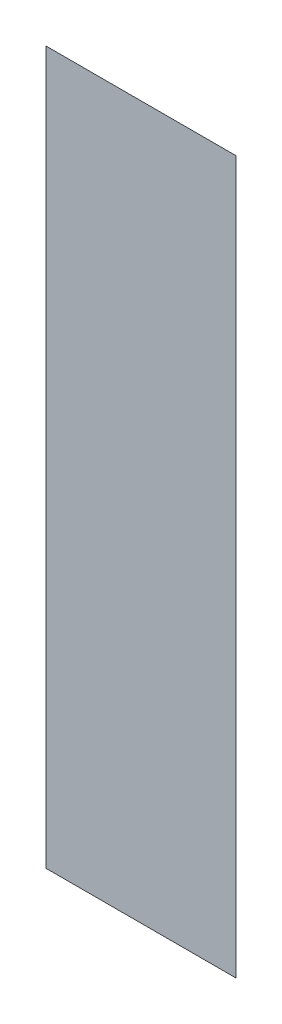
ISO-10303-21;
HEADER;
FILE_DESCRIPTION(('STEP AP214'),'2;1');
FILE_NAME('part.step','',(''),(''),'','','');
FILE_SCHEMA(('AUTOMOTIVE_DESIGN { 1 0 10303 214 1 1 1 1 }'));
ENDSEC;
DATA;
#1=APPLICATION_CONTEXT('core data for automotive mechanical design processes');
#2=APPLICATION_PROTOCOL_DEFINITION('international standard','automotive_design',2000,#1);
#3=PRODUCT_CONTEXT('',#1,'mechanical');
#4=PRODUCT('Part','Part','',(#3));
#5=PRODUCT_RELATED_PRODUCT_CATEGORY('part','',(#4));
#6=PRODUCT_DEFINITION_FORMATION('','',#4);
#7=PRODUCT_DEFINITION_CONTEXT('part definition',#1,'design');
#8=PRODUCT_DEFINITION('design','',#6,#7);
#9=PRODUCT_DEFINITION_SHAPE('','',#8);
#10=(LENGTH_UNIT() NAMED_UNIT(*) SI_UNIT(.MILLI.,.METRE.));
#11=(NAMED_UNIT(*) PLANE_ANGLE_UNIT() SI_UNIT($,.RADIAN.));
#12=(NAMED_UNIT(*) SI_UNIT($,.STERADIAN.) SOLID_ANGLE_UNIT());
#13=UNCERTAINTY_MEASURE_WITH_UNIT(LENGTH_MEASURE(1.E-05),#10,'distance_accuracy_value','');
#14=(GEOMETRIC_REPRESENTATION_CONTEXT(3) GLOBAL_UNCERTAINTY_ASSIGNED_CONTEXT((#13)) GLOBAL_UNIT_ASSIGNED_CONTEXT((#10,
#11,#12)) REPRESENTATION_CONTEXT('',''));
#15=CARTESIAN_POINT('',(0.,0.,0.));
#16=DIRECTION('',(0.,0.,1.));
#17=DIRECTION('',(1.,0.,0.));
#18=AXIS2_PLACEMENT_3D('',#15,#16,#17);
#19=CARTESIAN_POINT('',(-0.526839360236785,-0.708421616918198,0.0889425196850394));
#20=DIRECTION('',(0.,0.,1.));
#21=DIRECTION('',(0.,-1.,0.));
#22=AXIS2_PLACEMENT_3D('',#19,#20,#21);
#23=PLANE('',#22);
#24=CARTESIAN_POINT('',(-0.537422037402139,-0.710311380697725,0.0889425196850394));
#25=DIRECTION('',(1.,0.,0.));
#26=VECTOR('',#25,1.);
#27=LINE('',#24,#26);
#28=CARTESIAN_POINT('',(-0.537422037402139,-0.710311380697725,0.0890685039370079));
#29=VERTEX_POINT('',#28);
#30=CARTESIAN_POINT('',(-0.527343297244659,-0.710311380697725,0.0890685039370079));
#31=VERTEX_POINT('',#30);
#32=EDGE_CURVE('E50',#29,#31,#27,.T.);
#33=ORIENTED_EDGE('',*,*,#32,.T.);
#34=CARTESIAN_POINT('',(-0.527343297244659,-0.710311380697725,0.0889425196850394));
#35=DIRECTION('',(0.,-1.,0.));
#36=VECTOR('',#35,1.);
#37=LINE('',#34,#36);
#38=CARTESIAN_POINT('',(-0.527343297244659,-0.748106656288277,0.0890685039370079));
#39=VERTEX_POINT('',#38);
#40=EDGE_CURVE('E28',#31,#39,#37,.T.);
#41=ORIENTED_EDGE('',*,*,#40,.T.);
#42=CARTESIAN_POINT('',(-0.527343297244659,-0.748106656288277,0.0889425196850394));
#43=DIRECTION('',(-1.,0.,0.));
#44=VECTOR('',#43,1.);
#45=LINE('',#42,#44);
#46=CARTESIAN_POINT('',(-0.537422037402139,-0.748106656288277,0.0890685039370079));
#47=VERTEX_POINT('',#46);
#48=EDGE_CURVE('E11',#39,#47,#45,.T.);
#49=ORIENTED_EDGE('',*,*,#48,.T.);
#50=CARTESIAN_POINT('',(-0.537422037402139,-0.748106656288277,0.0889425196850394));
#51=DIRECTION('',(0.,1.,0.));
#52=VECTOR('',#51,1.);
#53=LINE('',#50,#52);
#54=EDGE_CURVE('E41',#47,#29,#53,.T.);
#55=ORIENTED_EDGE('',*,*,#54,.T.);
#56=EDGE_LOOP('',(#33,#41,#49,#55));
#57=FACE_BOUND('',#56,.T.);
#58=ADVANCED_FACE('F17',(#57),#23,.F.);
#59=CARTESIAN_POINT('',(-0.526839360236785,-0.708421616918198,0.0891944881889764));
#60=DIRECTION('',(0.,0.,1.));
#61=DIRECTION('',(0.,-1.,0.));
#62=AXIS2_PLACEMENT_3D('',#59,#60,#61);
#63=PLANE('',#62);
#64=ORIENTED_EDGE('',*,*,#40,.F.);
#65=ORIENTED_EDGE('',*,*,#32,.F.);
#66=ORIENTED_EDGE('',*,*,#54,.F.);
#67=ORIENTED_EDGE('',*,*,#48,.F.);
#68=EDGE_LOOP('',(#64,#65,#66,#67));
#69=FACE_BOUND('',#68,.T.);
#70=ADVANCED_FACE('F49',(#69),#63,.T.);
#71=CLOSED_SHELL('',(#58,#70));
#72=MANIFOLD_SOLID_BREP('B1',#71);
#73=ADVANCED_BREP_SHAPE_REPRESENTATION('',(#18,#72),#14);
#74=SHAPE_DEFINITION_REPRESENTATION(#9,#73);
ENDSEC;
END-ISO-10303-21;
